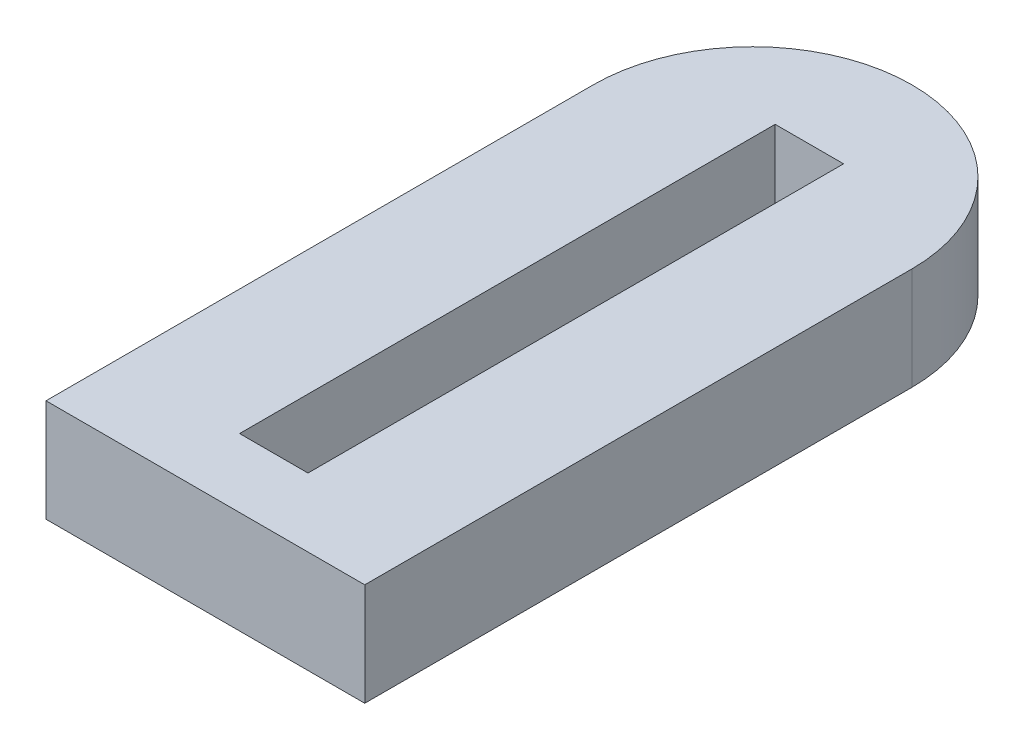
ISO-10303-21;
HEADER;
FILE_DESCRIPTION(('STEP AP214'),'2;1');
FILE_NAME('part.step','',(''),(''),'','','');
FILE_SCHEMA(('AUTOMOTIVE_DESIGN { 1 0 10303 214 1 1 1 1 }'));
ENDSEC;
DATA;
#1=APPLICATION_CONTEXT('core data for automotive mechanical design processes');
#2=APPLICATION_PROTOCOL_DEFINITION('international standard','automotive_design',2000,#1);
#3=PRODUCT_CONTEXT('',#1,'mechanical');
#4=PRODUCT('Part','Part','',(#3));
#5=PRODUCT_RELATED_PRODUCT_CATEGORY('part','',(#4));
#6=PRODUCT_DEFINITION_FORMATION('','',#4);
#7=PRODUCT_DEFINITION_CONTEXT('part definition',#1,'design');
#8=PRODUCT_DEFINITION('design','',#6,#7);
#9=PRODUCT_DEFINITION_SHAPE('','',#8);
#10=(LENGTH_UNIT() NAMED_UNIT(*) SI_UNIT(.MILLI.,.METRE.));
#11=(NAMED_UNIT(*) PLANE_ANGLE_UNIT() SI_UNIT($,.RADIAN.));
#12=(NAMED_UNIT(*) SI_UNIT($,.STERADIAN.) SOLID_ANGLE_UNIT());
#13=UNCERTAINTY_MEASURE_WITH_UNIT(LENGTH_MEASURE(1.E-05),#10,'distance_accuracy_value','');
#14=(GEOMETRIC_REPRESENTATION_CONTEXT(3) GLOBAL_UNCERTAINTY_ASSIGNED_CONTEXT((#13)) GLOBAL_UNIT_ASSIGNED_CONTEXT((#10,
#11,#12)) REPRESENTATION_CONTEXT('',''));
#15=CARTESIAN_POINT('',(0.,0.,0.));
#16=DIRECTION('',(0.,0.,1.));
#17=DIRECTION('',(1.,0.,0.));
#18=AXIS2_PLACEMENT_3D('',#15,#16,#17);
#19=CARTESIAN_POINT('',(-29.591,19.05,-101.6));
#20=DIRECTION('',(0.,-1.,0.));
#21=DIRECTION('',(0.,0.,-1.));
#22=AXIS2_PLACEMENT_3D('',#19,#20,#21);
#23=PLANE('',#22);
#24=DIRECTION('',(0.,0.,1.));
#25=VECTOR('',#24,1.);
#26=CARTESIAN_POINT('',(-59.182,19.05,0.));
#27=LINE('',#26,#25);
#28=CARTESIAN_POINT('',(-59.182,19.05,-101.6));
#29=VERTEX_POINT('',#28);
#30=CARTESIAN_POINT('',(-59.182,19.05,0.));
#31=VERTEX_POINT('',#30);
#32=EDGE_CURVE('E133',#29,#31,#27,.T.);
#33=ORIENTED_EDGE('',*,*,#32,.T.);
#34=DIRECTION('',(1.,0.,0.));
#35=VECTOR('',#34,1.);
#36=CARTESIAN_POINT('',(-59.182,19.05,0.));
#37=LINE('',#36,#35);
#38=CARTESIAN_POINT('',(0.,19.05,0.));
#39=VERTEX_POINT('',#38);
#40=EDGE_CURVE('E136',#31,#39,#37,.T.);
#41=ORIENTED_EDGE('',*,*,#40,.T.);
#42=DIRECTION('',(0.,0.,-1.));
#43=VECTOR('',#42,1.);
#44=CARTESIAN_POINT('',(0.,19.05,-101.6));
#45=LINE('',#44,#43);
#46=CARTESIAN_POINT('',(0.,19.05,-101.6));
#47=VERTEX_POINT('',#46);
#48=EDGE_CURVE('E139',#39,#47,#45,.T.);
#49=ORIENTED_EDGE('',*,*,#48,.T.);
#50=CARTESIAN_POINT('',(-29.591,19.05,-101.6));
#51=DIRECTION('',(0.,1.,0.));
#52=DIRECTION('',(0.,0.,-1.));
#53=AXIS2_PLACEMENT_3D('',#50,#51,#52);
#54=CIRCLE('',#53,29.591);
#55=EDGE_CURVE('E141',#47,#29,#54,.T.);
#56=ORIENTED_EDGE('',*,*,#55,.T.);
#57=EDGE_LOOP('',(#33,#41,#49,#56));
#58=FACE_BOUND('',#57,.T.);
#59=DIRECTION('',(0.,0.,1.));
#60=VECTOR('',#59,1.);
#61=CARTESIAN_POINT('',(-35.941,19.05,-112.141));
#62=LINE('',#61,#60);
#63=CARTESIAN_POINT('',(-35.941,19.05,-112.141));
#64=VERTEX_POINT('',#63);
#65=CARTESIAN_POINT('',(-35.941,19.05,-12.7));
#66=VERTEX_POINT('',#65);
#67=EDGE_CURVE('E97',#64,#66,#62,.T.);
#68=ORIENTED_EDGE('',*,*,#67,.F.);
#69=DIRECTION('',(-1.,0.,0.));
#70=VECTOR('',#69,1.);
#71=CARTESIAN_POINT('',(-23.241,19.05,-112.141));
#72=LINE('',#71,#70);
#73=CARTESIAN_POINT('',(-23.241,19.05,-112.141));
#74=VERTEX_POINT('',#73);
#75=EDGE_CURVE('E119',#74,#64,#72,.T.);
#76=ORIENTED_EDGE('',*,*,#75,.F.);
#77=DIRECTION('',(0.,0.,-1.));
#78=VECTOR('',#77,1.);
#79=CARTESIAN_POINT('',(-23.241,19.05,-12.7));
#80=LINE('',#79,#78);
#81=CARTESIAN_POINT('',(-23.241,19.05,-12.7));
#82=VERTEX_POINT('',#81);
#83=EDGE_CURVE('E117',#82,#74,#80,.T.);
#84=ORIENTED_EDGE('',*,*,#83,.F.);
#85=DIRECTION('',(1.,0.,0.));
#86=VECTOR('',#85,1.);
#87=CARTESIAN_POINT('',(-35.941,19.05,-12.7));
#88=LINE('',#87,#86);
#89=EDGE_CURVE('E105',#66,#82,#88,.T.);
#90=ORIENTED_EDGE('',*,*,#89,.F.);
#91=EDGE_LOOP('',(#68,#76,#84,#90));
#92=FACE_BOUND('',#91,.T.);
#93=ADVANCED_FACE('F32',(#58,#92),#23,.F.);
#94=CARTESIAN_POINT('',(-29.591,0.,-101.6));
#95=DIRECTION('',(0.,-1.,0.));
#96=DIRECTION('',(0.,0.,-1.));
#97=AXIS2_PLACEMENT_3D('',#94,#95,#96);
#98=PLANE('',#97);
#99=DIRECTION('',(0.,0.,1.));
#100=VECTOR('',#99,1.);
#101=CARTESIAN_POINT('',(-59.182,0.,0.));
#102=LINE('',#101,#100);
#103=CARTESIAN_POINT('',(-59.182,0.,-101.6));
#104=VERTEX_POINT('',#103);
#105=CARTESIAN_POINT('',(-59.182,0.,0.));
#106=VERTEX_POINT('',#105);
#107=EDGE_CURVE('E113',#104,#106,#102,.T.);
#108=ORIENTED_EDGE('',*,*,#107,.F.);
#109=CARTESIAN_POINT('',(-29.591,0.,-101.6));
#110=DIRECTION('',(0.,1.,0.));
#111=DIRECTION('',(0.,0.,-1.));
#112=AXIS2_PLACEMENT_3D('',#109,#110,#111);
#113=CIRCLE('',#112,29.591);
#114=CARTESIAN_POINT('',(0.,0.,-101.6));
#115=VERTEX_POINT('',#114);
#116=EDGE_CURVE('E137',#115,#104,#113,.T.);
#117=ORIENTED_EDGE('',*,*,#116,.F.);
#118=DIRECTION('',(0.,0.,-1.));
#119=VECTOR('',#118,1.);
#120=CARTESIAN_POINT('',(0.,0.,-101.6));
#121=LINE('',#120,#119);
#122=CARTESIAN_POINT('',(0.,0.,0.));
#123=VERTEX_POINT('',#122);
#124=EDGE_CURVE('E148',#123,#115,#121,.T.);
#125=ORIENTED_EDGE('',*,*,#124,.F.);
#126=DIRECTION('',(1.,0.,0.));
#127=VECTOR('',#126,1.);
#128=CARTESIAN_POINT('',(-59.182,0.,0.));
#129=LINE('',#128,#127);
#130=EDGE_CURVE('E146',#106,#123,#129,.T.);
#131=ORIENTED_EDGE('',*,*,#130,.F.);
#132=EDGE_LOOP('',(#108,#117,#125,#131));
#133=FACE_BOUND('',#132,.T.);
#134=DIRECTION('',(-1.,0.,0.));
#135=VECTOR('',#134,1.);
#136=CARTESIAN_POINT('',(-23.241,0.,-112.141));
#137=LINE('',#136,#135);
#138=CARTESIAN_POINT('',(-23.241,0.,-112.141));
#139=VERTEX_POINT('',#138);
#140=CARTESIAN_POINT('',(-35.941,0.,-112.141));
#141=VERTEX_POINT('',#140);
#142=EDGE_CURVE('E106',#139,#141,#137,.T.);
#143=ORIENTED_EDGE('',*,*,#142,.T.);
#144=DIRECTION('',(0.,0.,1.));
#145=VECTOR('',#144,1.);
#146=CARTESIAN_POINT('',(-35.941,0.,-112.141));
#147=LINE('',#146,#145);
#148=CARTESIAN_POINT('',(-35.941,0.,-12.7));
#149=VERTEX_POINT('',#148);
#150=EDGE_CURVE('E55',#141,#149,#147,.T.);
#151=ORIENTED_EDGE('',*,*,#150,.T.);
#152=DIRECTION('',(1.,0.,0.));
#153=VECTOR('',#152,1.);
#154=CARTESIAN_POINT('',(-35.941,0.,-12.7));
#155=LINE('',#154,#153);
#156=CARTESIAN_POINT('',(-23.241,0.,-12.7));
#157=VERTEX_POINT('',#156);
#158=EDGE_CURVE('E112',#149,#157,#155,.T.);
#159=ORIENTED_EDGE('',*,*,#158,.T.);
#160=DIRECTION('',(0.,0.,-1.));
#161=VECTOR('',#160,1.);
#162=CARTESIAN_POINT('',(-23.241,0.,-12.7));
#163=LINE('',#162,#161);
#164=EDGE_CURVE('E125',#157,#139,#163,.T.);
#165=ORIENTED_EDGE('',*,*,#164,.T.);
#166=EDGE_LOOP('',(#143,#151,#159,#165));
#167=FACE_BOUND('',#166,.T.);
#168=ADVANCED_FACE('F166',(#133,#167),#98,.T.);
#169=CARTESIAN_POINT('',(-59.182,19.05,0.));
#170=DIRECTION('',(1.,0.,0.));
#171=DIRECTION('',(0.,0.,-1.));
#172=AXIS2_PLACEMENT_3D('',#169,#170,#171);
#173=PLANE('',#172);
#174=ORIENTED_EDGE('',*,*,#107,.T.);
#175=DIRECTION('',(0.,-1.,0.));
#176=VECTOR('',#175,1.);
#177=CARTESIAN_POINT('',(-59.182,19.05,0.));
#178=LINE('',#177,#176);
#179=EDGE_CURVE('E11',#31,#106,#178,.T.);
#180=ORIENTED_EDGE('',*,*,#179,.F.);
#181=ORIENTED_EDGE('',*,*,#32,.F.);
#182=DIRECTION('',(0.,-1.,0.));
#183=VECTOR('',#182,1.);
#184=CARTESIAN_POINT('',(-59.182,19.05,-101.6));
#185=LINE('',#184,#183);
#186=EDGE_CURVE('E143',#29,#104,#185,.T.);
#187=ORIENTED_EDGE('',*,*,#186,.T.);
#188=EDGE_LOOP('',(#174,#180,#181,#187));
#189=FACE_BOUND('',#188,.T.);
#190=ADVANCED_FACE('F34',(#189),#173,.F.);
#191=CARTESIAN_POINT('',(-59.182,19.05,0.));
#192=DIRECTION('',(0.,0.,-1.));
#193=DIRECTION('',(-1.,0.,0.));
#194=AXIS2_PLACEMENT_3D('',#191,#192,#193);
#195=PLANE('',#194);
#196=ORIENTED_EDGE('',*,*,#130,.T.);
#197=DIRECTION('',(0.,-1.,0.));
#198=VECTOR('',#197,1.);
#199=CARTESIAN_POINT('',(0.,19.05,0.));
#200=LINE('',#199,#198);
#201=EDGE_CURVE('E40',#39,#123,#200,.T.);
#202=ORIENTED_EDGE('',*,*,#201,.F.);
#203=ORIENTED_EDGE('',*,*,#40,.F.);
#204=ORIENTED_EDGE('',*,*,#179,.T.);
#205=EDGE_LOOP('',(#196,#202,#203,#204));
#206=FACE_BOUND('',#205,.T.);
#207=ADVANCED_FACE('F176',(#206),#195,.F.);
#208=CARTESIAN_POINT('',(0.,19.05,-101.6));
#209=DIRECTION('',(-1.,0.,0.));
#210=DIRECTION('',(0.,0.,1.));
#211=AXIS2_PLACEMENT_3D('',#208,#209,#210);
#212=PLANE('',#211);
#213=ORIENTED_EDGE('',*,*,#124,.T.);
#214=DIRECTION('',(0.,-1.,0.));
#215=VECTOR('',#214,1.);
#216=CARTESIAN_POINT('',(0.,19.05,-101.6));
#217=LINE('',#216,#215);
#218=EDGE_CURVE('E153',#47,#115,#217,.T.);
#219=ORIENTED_EDGE('',*,*,#218,.F.);
#220=ORIENTED_EDGE('',*,*,#48,.F.);
#221=ORIENTED_EDGE('',*,*,#201,.T.);
#222=EDGE_LOOP('',(#213,#219,#220,#221));
#223=FACE_BOUND('',#222,.T.);
#224=ADVANCED_FACE('F160',(#223),#212,.F.);
#225=CARTESIAN_POINT('',(-29.591,19.05,-101.6));
#226=DIRECTION('',(0.,-1.,0.));
#227=DIRECTION('',(0.,0.,-1.));
#228=AXIS2_PLACEMENT_3D('',#225,#226,#227);
#229=CYLINDRICAL_SURFACE('',#228,29.591);
#230=ORIENTED_EDGE('',*,*,#116,.T.);
#231=ORIENTED_EDGE('',*,*,#186,.F.);
#232=ORIENTED_EDGE('',*,*,#55,.F.);
#233=ORIENTED_EDGE('',*,*,#218,.T.);
#234=EDGE_LOOP('',(#230,#231,#232,#233));
#235=FACE_BOUND('',#234,.T.);
#236=ADVANCED_FACE('F170',(#235),#229,.T.);
#237=CARTESIAN_POINT('',(-35.941,19.05,-112.141));
#238=DIRECTION('',(1.,0.,0.));
#239=DIRECTION('',(0.,0.,-1.));
#240=AXIS2_PLACEMENT_3D('',#237,#238,#239);
#241=PLANE('',#240);
#242=ORIENTED_EDGE('',*,*,#150,.F.);
#243=DIRECTION('',(0.,-1.,0.));
#244=VECTOR('',#243,1.);
#245=CARTESIAN_POINT('',(-35.941,19.05,-112.141));
#246=LINE('',#245,#244);
#247=EDGE_CURVE('E101',#64,#141,#246,.T.);
#248=ORIENTED_EDGE('',*,*,#247,.F.);
#249=ORIENTED_EDGE('',*,*,#67,.T.);
#250=DIRECTION('',(0.,-1.,0.));
#251=VECTOR('',#250,1.);
#252=CARTESIAN_POINT('',(-35.941,19.05,-12.7));
#253=LINE('',#252,#251);
#254=EDGE_CURVE('E100',#66,#149,#253,.T.);
#255=ORIENTED_EDGE('',*,*,#254,.T.);
#256=EDGE_LOOP('',(#242,#248,#249,#255));
#257=FACE_BOUND('',#256,.T.);
#258=ADVANCED_FACE('F99',(#257),#241,.T.);
#259=CARTESIAN_POINT('',(-35.941,19.05,-12.7));
#260=DIRECTION('',(0.,0.,-1.));
#261=DIRECTION('',(-1.,0.,0.));
#262=AXIS2_PLACEMENT_3D('',#259,#260,#261);
#263=PLANE('',#262);
#264=ORIENTED_EDGE('',*,*,#158,.F.);
#265=ORIENTED_EDGE('',*,*,#254,.F.);
#266=ORIENTED_EDGE('',*,*,#89,.T.);
#267=DIRECTION('',(0.,-1.,0.));
#268=VECTOR('',#267,1.);
#269=CARTESIAN_POINT('',(-23.241,19.05,-12.7));
#270=LINE('',#269,#268);
#271=EDGE_CURVE('E114',#82,#157,#270,.T.);
#272=ORIENTED_EDGE('',*,*,#271,.T.);
#273=EDGE_LOOP('',(#264,#265,#266,#272));
#274=FACE_BOUND('',#273,.T.);
#275=ADVANCED_FACE('F109',(#274),#263,.T.);
#276=CARTESIAN_POINT('',(-23.241,19.05,-12.7));
#277=DIRECTION('',(-1.,0.,0.));
#278=DIRECTION('',(0.,0.,1.));
#279=AXIS2_PLACEMENT_3D('',#276,#277,#278);
#280=PLANE('',#279);
#281=ORIENTED_EDGE('',*,*,#164,.F.);
#282=ORIENTED_EDGE('',*,*,#271,.F.);
#283=ORIENTED_EDGE('',*,*,#83,.T.);
#284=DIRECTION('',(0.,-1.,0.));
#285=VECTOR('',#284,1.);
#286=CARTESIAN_POINT('',(-23.241,19.05,-112.141));
#287=LINE('',#286,#285);
#288=EDGE_CURVE('E47',#74,#139,#287,.T.);
#289=ORIENTED_EDGE('',*,*,#288,.T.);
#290=EDGE_LOOP('',(#281,#282,#283,#289));
#291=FACE_BOUND('',#290,.T.);
#292=ADVANCED_FACE('F199',(#291),#280,.T.);
#293=CARTESIAN_POINT('',(-23.241,19.05,-112.141));
#294=DIRECTION('',(0.,0.,1.));
#295=DIRECTION('',(1.,0.,0.));
#296=AXIS2_PLACEMENT_3D('',#293,#294,#295);
#297=PLANE('',#296);
#298=ORIENTED_EDGE('',*,*,#142,.F.);
#299=ORIENTED_EDGE('',*,*,#288,.F.);
#300=ORIENTED_EDGE('',*,*,#75,.T.);
#301=ORIENTED_EDGE('',*,*,#247,.T.);
#302=EDGE_LOOP('',(#298,#299,#300,#301));
#303=FACE_BOUND('',#302,.T.);
#304=ADVANCED_FACE('F203',(#303),#297,.T.);
#305=CLOSED_SHELL('',(#93,#168,#190,#207,#224,#236,#258,#275,#292,#304));
#306=MANIFOLD_SOLID_BREP('B2',#305);
#307=ADVANCED_BREP_SHAPE_REPRESENTATION('',(#18,#306),#14);
#308=SHAPE_DEFINITION_REPRESENTATION(#9,#307);
ENDSEC;
END-ISO-10303-21;
